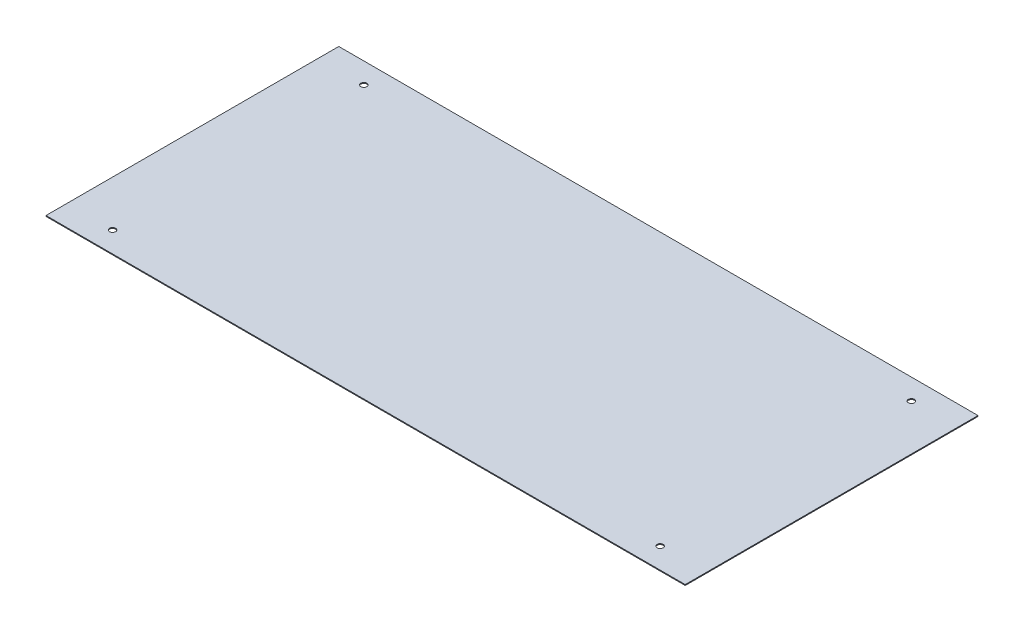
ISO-10303-21;
HEADER;
FILE_DESCRIPTION(('STEP AP214'),'2;1');
FILE_NAME('part.step','',(''),(''),'','','');
FILE_SCHEMA(('AUTOMOTIVE_DESIGN { 1 0 10303 214 1 1 1 1 }'));
ENDSEC;
DATA;
#1=APPLICATION_CONTEXT('core data for automotive mechanical design processes');
#2=APPLICATION_PROTOCOL_DEFINITION('international standard','automotive_design',2000,#1);
#3=PRODUCT_CONTEXT('',#1,'mechanical');
#4=PRODUCT('Part','Part','',(#3));
#5=PRODUCT_RELATED_PRODUCT_CATEGORY('part','',(#4));
#6=PRODUCT_DEFINITION_FORMATION('','',#4);
#7=PRODUCT_DEFINITION_CONTEXT('part definition',#1,'design');
#8=PRODUCT_DEFINITION('design','',#6,#7);
#9=PRODUCT_DEFINITION_SHAPE('','',#8);
#10=(LENGTH_UNIT() NAMED_UNIT(*) SI_UNIT(.MILLI.,.METRE.));
#11=(NAMED_UNIT(*) PLANE_ANGLE_UNIT() SI_UNIT($,.RADIAN.));
#12=(NAMED_UNIT(*) SI_UNIT($,.STERADIAN.) SOLID_ANGLE_UNIT());
#13=UNCERTAINTY_MEASURE_WITH_UNIT(LENGTH_MEASURE(1.E-05),#10,'distance_accuracy_value','');
#14=(GEOMETRIC_REPRESENTATION_CONTEXT(3) GLOBAL_UNCERTAINTY_ASSIGNED_CONTEXT((#13)) GLOBAL_UNIT_ASSIGNED_CONTEXT((#10,
#11,#12)) REPRESENTATION_CONTEXT('',''));
#15=CARTESIAN_POINT('',(0.,0.,0.));
#16=DIRECTION('',(0.,0.,1.));
#17=DIRECTION('',(1.,0.,0.));
#18=AXIS2_PLACEMENT_3D('',#15,#16,#17);
#19=CARTESIAN_POINT('',(0.,1.,0.));
#20=DIRECTION('',(0.,1.,0.));
#21=DIRECTION('',(0.,0.,1.));
#22=AXIS2_PLACEMENT_3D('',#19,#20,#21);
#23=PLANE('',#22);
#24=CARTESIAN_POINT('',(316.061908403153,1.,144.999999999997));
#25=DIRECTION('',(0.,1.,0.));
#26=DIRECTION('',(0.,0.,1.));
#27=AXIS2_PLACEMENT_3D('',#24,#25,#26);
#28=CIRCLE('',#27,3.50000000000002);
#29=CARTESIAN_POINT('',(316.061908403153,1.,148.499999999997));
#30=VERTEX_POINT('',#29);
#31=EDGE_CURVE('E148',#30,#30,#28,.T.);
#32=ORIENTED_EDGE('',*,*,#31,.F.);
#33=EDGE_LOOP('',(#32));
#34=FACE_BOUND('',#33,.T.);
#35=CARTESIAN_POINT('',(-316.061908403132,1.,-145.00000000002));
#36=DIRECTION('',(0.,1.,0.));
#37=DIRECTION('',(0.,0.,1.));
#38=AXIS2_PLACEMENT_3D('',#35,#36,#37);
#39=CIRCLE('',#38,3.50000000000002);
#40=CARTESIAN_POINT('',(-316.061908403132,1.,-141.50000000002));
#41=VERTEX_POINT('',#40);
#42=EDGE_CURVE('E118',#41,#41,#39,.T.);
#43=ORIENTED_EDGE('',*,*,#42,.F.);
#44=EDGE_LOOP('',(#43));
#45=FACE_BOUND('',#44,.T.);
#46=DIRECTION('',(0.,0.,-1.));
#47=VECTOR('',#46,1.);
#48=CARTESIAN_POINT('',(369.,1.,169.));
#49=LINE('',#48,#47);
#50=CARTESIAN_POINT('',(369.,1.,169.));
#51=VERTEX_POINT('',#50);
#52=CARTESIAN_POINT('',(369.,1.,-169.));
#53=VERTEX_POINT('',#52);
#54=EDGE_CURVE('E98',#51,#53,#49,.T.);
#55=ORIENTED_EDGE('',*,*,#54,.T.);
#56=DIRECTION('',(-1.,0.,0.));
#57=VECTOR('',#56,1.);
#58=CARTESIAN_POINT('',(369.,1.,-169.));
#59=LINE('',#58,#57);
#60=CARTESIAN_POINT('',(-369.,1.,-169.));
#61=VERTEX_POINT('',#60);
#62=EDGE_CURVE('E93',#53,#61,#59,.T.);
#63=ORIENTED_EDGE('',*,*,#62,.T.);
#64=DIRECTION('',(0.,0.,1.));
#65=VECTOR('',#64,1.);
#66=CARTESIAN_POINT('',(-369.,1.,169.));
#67=LINE('',#66,#65);
#68=CARTESIAN_POINT('',(-369.,1.,169.));
#69=VERTEX_POINT('',#68);
#70=EDGE_CURVE('E96',#61,#69,#67,.T.);
#71=ORIENTED_EDGE('',*,*,#70,.T.);
#72=DIRECTION('',(1.,0.,0.));
#73=VECTOR('',#72,1.);
#74=CARTESIAN_POINT('',(369.,1.,169.));
#75=LINE('',#74,#73);
#76=EDGE_CURVE('E63',#69,#51,#75,.T.);
#77=ORIENTED_EDGE('',*,*,#76,.T.);
#78=EDGE_LOOP('',(#55,#63,#71,#77));
#79=FACE_BOUND('',#78,.T.);
#80=CARTESIAN_POINT('',(-316.061908403132,1.,144.999999999997));
#81=DIRECTION('',(0.,1.,0.));
#82=DIRECTION('',(0.,0.,1.));
#83=AXIS2_PLACEMENT_3D('',#80,#81,#82);
#84=CIRCLE('',#83,3.50000000000002);
#85=CARTESIAN_POINT('',(-316.061908403132,1.,148.499999999997));
#86=VERTEX_POINT('',#85);
#87=EDGE_CURVE('E140',#86,#86,#84,.T.);
#88=ORIENTED_EDGE('',*,*,#87,.F.);
#89=EDGE_LOOP('',(#88));
#90=FACE_BOUND('',#89,.T.);
#91=CARTESIAN_POINT('',(316.061908403153,1.,-145.00000000002));
#92=DIRECTION('',(0.,1.,0.));
#93=DIRECTION('',(0.,0.,1.));
#94=AXIS2_PLACEMENT_3D('',#91,#92,#93);
#95=CIRCLE('',#94,3.50000000000002);
#96=CARTESIAN_POINT('',(316.061908403153,1.,-141.50000000002));
#97=VERTEX_POINT('',#96);
#98=EDGE_CURVE('E156',#97,#97,#95,.T.);
#99=ORIENTED_EDGE('',*,*,#98,.F.);
#100=EDGE_LOOP('',(#99));
#101=FACE_BOUND('',#100,.T.);
#102=ADVANCED_FACE('F45',(#34,#45,#79,#90,#101),#23,.T.);
#103=CARTESIAN_POINT('',(0.,0.,0.));
#104=DIRECTION('',(0.,1.,0.));
#105=DIRECTION('',(0.,0.,1.));
#106=AXIS2_PLACEMENT_3D('',#103,#104,#105);
#107=PLANE('',#106);
#108=DIRECTION('',(0.,0.,-1.));
#109=VECTOR('',#108,1.);
#110=CARTESIAN_POINT('',(369.,0.,169.));
#111=LINE('',#110,#109);
#112=CARTESIAN_POINT('',(369.,0.,169.));
#113=VERTEX_POINT('',#112);
#114=CARTESIAN_POINT('',(369.,0.,-169.));
#115=VERTEX_POINT('',#114);
#116=EDGE_CURVE('E114',#113,#115,#111,.T.);
#117=ORIENTED_EDGE('',*,*,#116,.F.);
#118=DIRECTION('',(1.,0.,0.));
#119=VECTOR('',#118,1.);
#120=CARTESIAN_POINT('',(369.,0.,169.));
#121=LINE('',#120,#119);
#122=CARTESIAN_POINT('',(-369.,0.,169.));
#123=VERTEX_POINT('',#122);
#124=EDGE_CURVE('E86',#123,#113,#121,.T.);
#125=ORIENTED_EDGE('',*,*,#124,.F.);
#126=DIRECTION('',(0.,0.,1.));
#127=VECTOR('',#126,1.);
#128=CARTESIAN_POINT('',(-369.,0.,169.));
#129=LINE('',#128,#127);
#130=CARTESIAN_POINT('',(-369.,0.,-169.));
#131=VERTEX_POINT('',#130);
#132=EDGE_CURVE('E80',#131,#123,#129,.T.);
#133=ORIENTED_EDGE('',*,*,#132,.F.);
#134=DIRECTION('',(-1.,0.,0.));
#135=VECTOR('',#134,1.);
#136=CARTESIAN_POINT('',(369.,0.,-169.));
#137=LINE('',#136,#135);
#138=EDGE_CURVE('E103',#115,#131,#137,.T.);
#139=ORIENTED_EDGE('',*,*,#138,.F.);
#140=EDGE_LOOP('',(#117,#125,#133,#139));
#141=FACE_BOUND('',#140,.T.);
#142=CARTESIAN_POINT('',(-316.061908403132,0.,-145.00000000002));
#143=DIRECTION('',(0.,1.,0.));
#144=DIRECTION('',(0.,0.,1.));
#145=AXIS2_PLACEMENT_3D('',#142,#143,#144);
#146=CIRCLE('',#145,3.50000000000002);
#147=CARTESIAN_POINT('',(-316.061908403132,0.,-141.50000000002));
#148=VERTEX_POINT('',#147);
#149=EDGE_CURVE('E136',#148,#148,#146,.T.);
#150=ORIENTED_EDGE('',*,*,#149,.T.);
#151=EDGE_LOOP('',(#150));
#152=FACE_BOUND('',#151,.T.);
#153=CARTESIAN_POINT('',(-316.061908403132,0.,144.999999999997));
#154=DIRECTION('',(0.,1.,0.));
#155=DIRECTION('',(0.,0.,1.));
#156=AXIS2_PLACEMENT_3D('',#153,#154,#155);
#157=CIRCLE('',#156,3.50000000000002);
#158=CARTESIAN_POINT('',(-316.061908403132,0.,148.499999999997));
#159=VERTEX_POINT('',#158);
#160=EDGE_CURVE('E144',#159,#159,#157,.T.);
#161=ORIENTED_EDGE('',*,*,#160,.T.);
#162=EDGE_LOOP('',(#161));
#163=FACE_BOUND('',#162,.T.);
#164=CARTESIAN_POINT('',(316.061908403153,0.,144.999999999997));
#165=DIRECTION('',(0.,1.,0.));
#166=DIRECTION('',(0.,0.,1.));
#167=AXIS2_PLACEMENT_3D('',#164,#165,#166);
#168=CIRCLE('',#167,3.50000000000002);
#169=CARTESIAN_POINT('',(316.061908403153,0.,148.499999999997));
#170=VERTEX_POINT('',#169);
#171=EDGE_CURVE('E152',#170,#170,#168,.T.);
#172=ORIENTED_EDGE('',*,*,#171,.T.);
#173=EDGE_LOOP('',(#172));
#174=FACE_BOUND('',#173,.T.);
#175=CARTESIAN_POINT('',(316.061908403153,0.,-145.00000000002));
#176=DIRECTION('',(0.,1.,0.));
#177=DIRECTION('',(0.,0.,1.));
#178=AXIS2_PLACEMENT_3D('',#175,#176,#177);
#179=CIRCLE('',#178,3.50000000000002);
#180=CARTESIAN_POINT('',(316.061908403153,0.,-141.50000000002));
#181=VERTEX_POINT('',#180);
#182=EDGE_CURVE('E160',#181,#181,#179,.T.);
#183=ORIENTED_EDGE('',*,*,#182,.T.);
#184=EDGE_LOOP('',(#183));
#185=FACE_BOUND('',#184,.T.);
#186=ADVANCED_FACE('F131',(#141,#152,#163,#174,#185),#107,.F.);
#187=CARTESIAN_POINT('',(369.,1.,169.));
#188=DIRECTION('',(-1.,0.,0.));
#189=DIRECTION('',(0.,0.,1.));
#190=AXIS2_PLACEMENT_3D('',#187,#188,#189);
#191=PLANE('',#190);
#192=ORIENTED_EDGE('',*,*,#116,.T.);
#193=DIRECTION('',(0.,-1.,0.));
#194=VECTOR('',#193,1.);
#195=CARTESIAN_POINT('',(369.,1.,-169.));
#196=LINE('',#195,#194);
#197=EDGE_CURVE('E11',#53,#115,#196,.T.);
#198=ORIENTED_EDGE('',*,*,#197,.F.);
#199=ORIENTED_EDGE('',*,*,#54,.F.);
#200=DIRECTION('',(0.,-1.,0.));
#201=VECTOR('',#200,1.);
#202=CARTESIAN_POINT('',(369.,1.,169.));
#203=LINE('',#202,#201);
#204=EDGE_CURVE('E110',#51,#113,#203,.T.);
#205=ORIENTED_EDGE('',*,*,#204,.T.);
#206=EDGE_LOOP('',(#192,#198,#199,#205));
#207=FACE_BOUND('',#206,.T.);
#208=ADVANCED_FACE('F47',(#207),#191,.F.);
#209=CARTESIAN_POINT('',(369.,1.,-169.));
#210=DIRECTION('',(0.,0.,1.));
#211=DIRECTION('',(1.,0.,0.));
#212=AXIS2_PLACEMENT_3D('',#209,#210,#211);
#213=PLANE('',#212);
#214=ORIENTED_EDGE('',*,*,#138,.T.);
#215=DIRECTION('',(0.,-1.,0.));
#216=VECTOR('',#215,1.);
#217=CARTESIAN_POINT('',(-369.,1.,-169.));
#218=LINE('',#217,#216);
#219=EDGE_CURVE('E55',#61,#131,#218,.T.);
#220=ORIENTED_EDGE('',*,*,#219,.F.);
#221=ORIENTED_EDGE('',*,*,#62,.F.);
#222=ORIENTED_EDGE('',*,*,#197,.T.);
#223=EDGE_LOOP('',(#214,#220,#221,#222));
#224=FACE_BOUND('',#223,.T.);
#225=ADVANCED_FACE('F102',(#224),#213,.F.);
#226=CARTESIAN_POINT('',(-369.,1.,169.));
#227=DIRECTION('',(1.,0.,0.));
#228=DIRECTION('',(0.,0.,-1.));
#229=AXIS2_PLACEMENT_3D('',#226,#227,#228);
#230=PLANE('',#229);
#231=ORIENTED_EDGE('',*,*,#132,.T.);
#232=DIRECTION('',(0.,-1.,0.));
#233=VECTOR('',#232,1.);
#234=CARTESIAN_POINT('',(-369.,1.,169.));
#235=LINE('',#234,#233);
#236=EDGE_CURVE('E105',#69,#123,#235,.T.);
#237=ORIENTED_EDGE('',*,*,#236,.F.);
#238=ORIENTED_EDGE('',*,*,#70,.F.);
#239=ORIENTED_EDGE('',*,*,#219,.T.);
#240=EDGE_LOOP('',(#231,#237,#238,#239));
#241=FACE_BOUND('',#240,.T.);
#242=ADVANCED_FACE('F106',(#241),#230,.F.);
#243=CARTESIAN_POINT('',(369.,1.,169.));
#244=DIRECTION('',(0.,0.,-1.));
#245=DIRECTION('',(-1.,0.,0.));
#246=AXIS2_PLACEMENT_3D('',#243,#244,#245);
#247=PLANE('',#246);
#248=ORIENTED_EDGE('',*,*,#124,.T.);
#249=ORIENTED_EDGE('',*,*,#204,.F.);
#250=ORIENTED_EDGE('',*,*,#76,.F.);
#251=ORIENTED_EDGE('',*,*,#236,.T.);
#252=EDGE_LOOP('',(#248,#249,#250,#251));
#253=FACE_BOUND('',#252,.T.);
#254=ADVANCED_FACE('F128',(#253),#247,.F.);
#255=CARTESIAN_POINT('',(-316.061908403132,1.,-145.00000000002));
#256=DIRECTION('',(0.,-1.,0.));
#257=DIRECTION('',(0.,0.,-1.));
#258=AXIS2_PLACEMENT_3D('',#255,#256,#257);
#259=CYLINDRICAL_SURFACE('',#258,3.50000000000002);
#260=ORIENTED_EDGE('',*,*,#42,.T.);
#261=EDGE_LOOP('',(#260));
#262=FACE_BOUND('',#261,.T.);
#263=ORIENTED_EDGE('',*,*,#149,.F.);
#264=EDGE_LOOP('',(#263));
#265=FACE_BOUND('',#264,.T.);
#266=ADVANCED_FACE('F181',(#262,#265),#259,.F.);
#267=CARTESIAN_POINT('',(-316.061908403132,1.,144.999999999997));
#268=DIRECTION('',(0.,-1.,0.));
#269=DIRECTION('',(0.,0.,-1.));
#270=AXIS2_PLACEMENT_3D('',#267,#268,#269);
#271=CYLINDRICAL_SURFACE('',#270,3.50000000000002);
#272=ORIENTED_EDGE('',*,*,#87,.T.);
#273=EDGE_LOOP('',(#272));
#274=FACE_BOUND('',#273,.T.);
#275=ORIENTED_EDGE('',*,*,#160,.F.);
#276=EDGE_LOOP('',(#275));
#277=FACE_BOUND('',#276,.T.);
#278=ADVANCED_FACE('F226',(#274,#277),#271,.F.);
#279=CARTESIAN_POINT('',(316.061908403153,1.,144.999999999997));
#280=DIRECTION('',(0.,-1.,0.));
#281=DIRECTION('',(0.,0.,-1.));
#282=AXIS2_PLACEMENT_3D('',#279,#280,#281);
#283=CYLINDRICAL_SURFACE('',#282,3.50000000000002);
#284=ORIENTED_EDGE('',*,*,#31,.T.);
#285=EDGE_LOOP('',(#284));
#286=FACE_BOUND('',#285,.T.);
#287=ORIENTED_EDGE('',*,*,#171,.F.);
#288=EDGE_LOOP('',(#287));
#289=FACE_BOUND('',#288,.T.);
#290=ADVANCED_FACE('F234',(#286,#289),#283,.F.);
#291=CARTESIAN_POINT('',(316.061908403153,1.,-145.00000000002));
#292=DIRECTION('',(0.,-1.,0.));
#293=DIRECTION('',(0.,0.,-1.));
#294=AXIS2_PLACEMENT_3D('',#291,#292,#293);
#295=CYLINDRICAL_SURFACE('',#294,3.50000000000002);
#296=ORIENTED_EDGE('',*,*,#98,.T.);
#297=EDGE_LOOP('',(#296));
#298=FACE_BOUND('',#297,.T.);
#299=ORIENTED_EDGE('',*,*,#182,.F.);
#300=EDGE_LOOP('',(#299));
#301=FACE_BOUND('',#300,.T.);
#302=ADVANCED_FACE('F168',(#298,#301),#295,.F.);
#303=CLOSED_SHELL('',(#102,#186,#208,#225,#242,#254,#266,#278,#290,#302));
#304=MANIFOLD_SOLID_BREP('B2',#303);
#305=ADVANCED_BREP_SHAPE_REPRESENTATION('',(#18,#304),#14);
#306=SHAPE_DEFINITION_REPRESENTATION(#9,#305);
ENDSEC;
END-ISO-10303-21;
